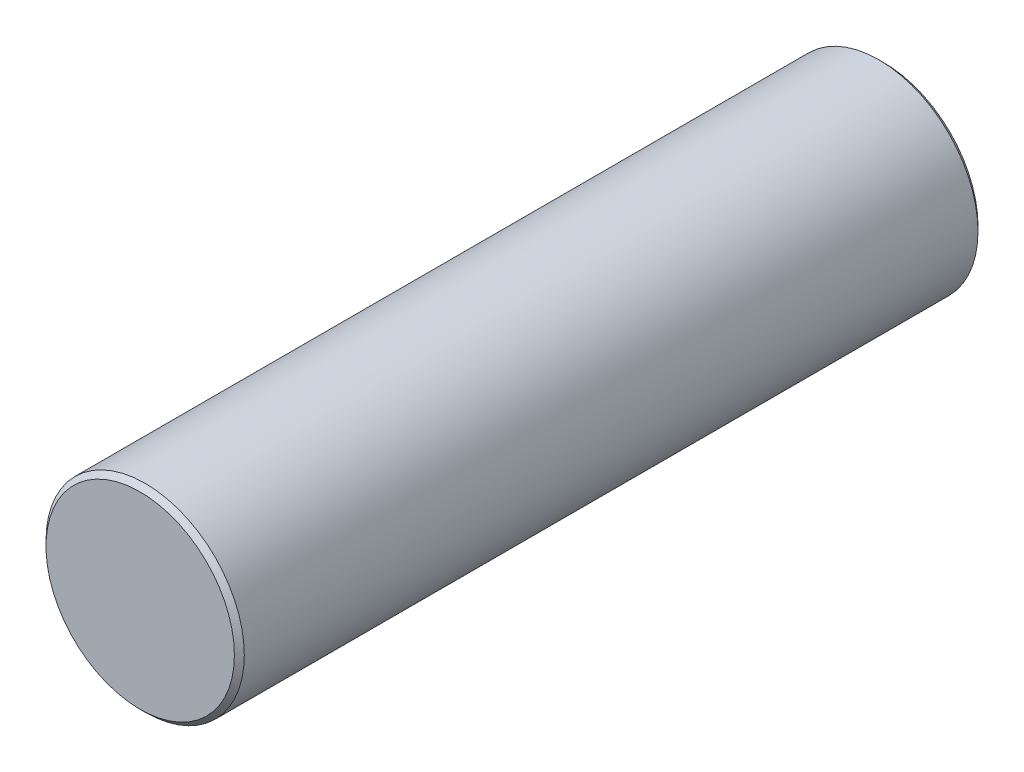
ISO-10303-21;
HEADER;
FILE_DESCRIPTION(('STEP AP214'),'2;1');
FILE_NAME('part.step','',(''),(''),'','','');
FILE_SCHEMA(('AUTOMOTIVE_DESIGN { 1 0 10303 214 1 1 1 1 }'));
ENDSEC;
DATA;
#1=APPLICATION_CONTEXT('core data for automotive mechanical design processes');
#2=APPLICATION_PROTOCOL_DEFINITION('international standard','automotive_design',2000,#1);
#3=PRODUCT_CONTEXT('',#1,'mechanical');
#4=PRODUCT('Part','Part','',(#3));
#5=PRODUCT_RELATED_PRODUCT_CATEGORY('part','',(#4));
#6=PRODUCT_DEFINITION_FORMATION('','',#4);
#7=PRODUCT_DEFINITION_CONTEXT('part definition',#1,'design');
#8=PRODUCT_DEFINITION('design','',#6,#7);
#9=PRODUCT_DEFINITION_SHAPE('','',#8);
#10=(LENGTH_UNIT() NAMED_UNIT(*) SI_UNIT(.MILLI.,.METRE.));
#11=(NAMED_UNIT(*) PLANE_ANGLE_UNIT() SI_UNIT($,.RADIAN.));
#12=(NAMED_UNIT(*) SI_UNIT($,.STERADIAN.) SOLID_ANGLE_UNIT());
#13=UNCERTAINTY_MEASURE_WITH_UNIT(LENGTH_MEASURE(1.E-05),#10,'distance_accuracy_value','');
#14=(GEOMETRIC_REPRESENTATION_CONTEXT(3) GLOBAL_UNCERTAINTY_ASSIGNED_CONTEXT((#13)) GLOBAL_UNIT_ASSIGNED_CONTEXT((#10,
#11,#12)) REPRESENTATION_CONTEXT('',''));
#15=CARTESIAN_POINT('',(0.,0.,0.));
#16=DIRECTION('',(0.,0.,1.));
#17=DIRECTION('',(1.,0.,0.));
#18=AXIS2_PLACEMENT_3D('',#15,#16,#17);
#19=CARTESIAN_POINT('',(0.,0.,150.));
#20=DIRECTION('',(0.,0.,-1.));
#21=DIRECTION('',(-1.,0.,0.));
#22=AXIS2_PLACEMENT_3D('',#19,#20,#21);
#23=CYLINDRICAL_SURFACE('',#22,20.);
#24=CARTESIAN_POINT('',(0.,0.,0.999999999999973));
#25=DIRECTION('',(0.,0.,1.));
#26=DIRECTION('',(1.,0.,0.));
#27=AXIS2_PLACEMENT_3D('',#24,#25,#26);
#28=CIRCLE('',#27,20.);
#29=CARTESIAN_POINT('',(20.,0.,0.999999999999973));
#30=VERTEX_POINT('',#29);
#31=EDGE_CURVE('E45',#30,#30,#28,.T.);
#32=ORIENTED_EDGE('',*,*,#31,.T.);
#33=EDGE_LOOP('',(#32));
#34=FACE_BOUND('',#33,.T.);
#35=CARTESIAN_POINT('',(0.,0.,149.));
#36=DIRECTION('',(0.,0.,1.));
#37=DIRECTION('',(1.,0.,0.));
#38=AXIS2_PLACEMENT_3D('',#35,#36,#37);
#39=CIRCLE('',#38,20.);
#40=CARTESIAN_POINT('',(20.,0.,149.));
#41=VERTEX_POINT('',#40);
#42=EDGE_CURVE('E49',#41,#41,#39,.F.);
#43=ORIENTED_EDGE('',*,*,#42,.T.);
#44=EDGE_LOOP('',(#43));
#45=FACE_BOUND('',#44,.T.);
#46=ADVANCED_FACE('F34',(#34,#45),#23,.T.);
#47=CARTESIAN_POINT('',(0.,0.,150.));
#48=DIRECTION('',(0.,0.,1.));
#49=DIRECTION('',(1.,0.,0.));
#50=AXIS2_PLACEMENT_3D('',#47,#48,#49);
#51=PLANE('',#50);
#52=CARTESIAN_POINT('',(0.,0.,150.));
#53=DIRECTION('',(0.,0.,1.));
#54=DIRECTION('',(1.,0.,0.));
#55=AXIS2_PLACEMENT_3D('',#52,#53,#54);
#56=CIRCLE('',#55,19.);
#57=CARTESIAN_POINT('',(19.,0.,150.));
#58=VERTEX_POINT('',#57);
#59=EDGE_CURVE('E10',#58,#58,#56,.T.);
#60=ORIENTED_EDGE('',*,*,#59,.T.);
#61=EDGE_LOOP('',(#60));
#62=FACE_BOUND('',#61,.T.);
#63=ADVANCED_FACE('F65',(#62),#51,.T.);
#64=CARTESIAN_POINT('',(0.,0.,0.));
#65=DIRECTION('',(0.,0.,1.));
#66=DIRECTION('',(1.,0.,0.));
#67=AXIS2_PLACEMENT_3D('',#64,#65,#66);
#68=PLANE('',#67);
#69=CARTESIAN_POINT('',(0.,0.,0.));
#70=DIRECTION('',(0.,0.,1.));
#71=DIRECTION('',(1.,0.,0.));
#72=AXIS2_PLACEMENT_3D('',#69,#70,#71);
#73=CIRCLE('',#72,19.);
#74=CARTESIAN_POINT('',(19.,0.,0.));
#75=VERTEX_POINT('',#74);
#76=EDGE_CURVE('E41',#75,#75,#73,.F.);
#77=ORIENTED_EDGE('',*,*,#76,.T.);
#78=EDGE_LOOP('',(#77));
#79=FACE_BOUND('',#78,.T.);
#80=ADVANCED_FACE('F62',(#79),#68,.F.);
#81=CARTESIAN_POINT('',(0.,0.,0.999999999999973));
#82=DIRECTION('',(0.,0.,1.));
#83=DIRECTION('',(1.,0.,0.));
#84=AXIS2_PLACEMENT_3D('',#81,#82,#83);
#85=CONICAL_SURFACE('',#84,20.,0.785398163397448);
#86=ORIENTED_EDGE('',*,*,#76,.F.);
#87=EDGE_LOOP('',(#86));
#88=FACE_BOUND('',#87,.T.);
#89=ORIENTED_EDGE('',*,*,#31,.F.);
#90=EDGE_LOOP('',(#89));
#91=FACE_BOUND('',#90,.T.);
#92=ADVANCED_FACE('F58',(#88,#91),#85,.T.);
#93=CARTESIAN_POINT('',(0.,0.,150.));
#94=DIRECTION('',(0.,0.,-1.));
#95=DIRECTION('',(-1.,0.,0.));
#96=AXIS2_PLACEMENT_3D('',#93,#94,#95);
#97=CONICAL_SURFACE('',#96,19.,0.785398163397435);
#98=ORIENTED_EDGE('',*,*,#42,.F.);
#99=EDGE_LOOP('',(#98));
#100=FACE_BOUND('',#99,.T.);
#101=ORIENTED_EDGE('',*,*,#59,.F.);
#102=EDGE_LOOP('',(#101));
#103=FACE_BOUND('',#102,.T.);
#104=ADVANCED_FACE('F36',(#100,#103),#97,.T.);
#105=CLOSED_SHELL('',(#46,#63,#80,#92,#104));
#106=MANIFOLD_SOLID_BREP('B2',#105);
#107=ADVANCED_BREP_SHAPE_REPRESENTATION('',(#18,#106),#14);
#108=SHAPE_DEFINITION_REPRESENTATION(#9,#107);
ENDSEC;
END-ISO-10303-21;
